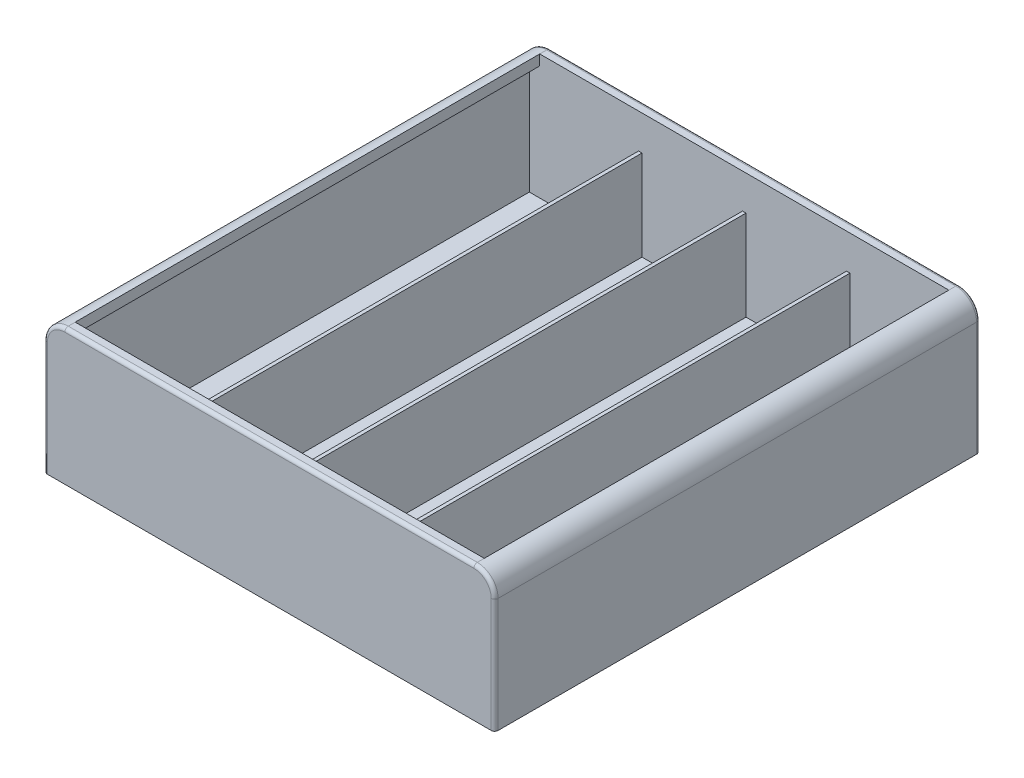
ISO-10303-21;
HEADER;
FILE_DESCRIPTION(('STEP AP214'),'2;1');
FILE_NAME('part.step','',(''),(''),'','','');
FILE_SCHEMA(('AUTOMOTIVE_DESIGN { 1 0 10303 214 1 1 1 1 }'));
ENDSEC;
DATA;
#1=APPLICATION_CONTEXT('core data for automotive mechanical design processes');
#2=APPLICATION_PROTOCOL_DEFINITION('international standard','automotive_design',2000,#1);
#3=PRODUCT_CONTEXT('',#1,'mechanical');
#4=PRODUCT('Part','Part','',(#3));
#5=PRODUCT_RELATED_PRODUCT_CATEGORY('part','',(#4));
#6=PRODUCT_DEFINITION_FORMATION('','',#4);
#7=PRODUCT_DEFINITION_CONTEXT('part definition',#1,'design');
#8=PRODUCT_DEFINITION('design','',#6,#7);
#9=PRODUCT_DEFINITION_SHAPE('','',#8);
#10=(LENGTH_UNIT() NAMED_UNIT(*) SI_UNIT(.MILLI.,.METRE.));
#11=(NAMED_UNIT(*) PLANE_ANGLE_UNIT() SI_UNIT($,.RADIAN.));
#12=(NAMED_UNIT(*) SI_UNIT($,.STERADIAN.) SOLID_ANGLE_UNIT());
#13=UNCERTAINTY_MEASURE_WITH_UNIT(LENGTH_MEASURE(1.E-05),#10,'distance_accuracy_value','');
#14=(GEOMETRIC_REPRESENTATION_CONTEXT(3) GLOBAL_UNCERTAINTY_ASSIGNED_CONTEXT((#13)) GLOBAL_UNIT_ASSIGNED_CONTEXT((#10,
#11,#12)) REPRESENTATION_CONTEXT('',''));
#15=CARTESIAN_POINT('',(0.,0.,0.));
#16=DIRECTION('',(0.,0.,1.));
#17=DIRECTION('',(1.,0.,0.));
#18=AXIS2_PLACEMENT_3D('',#15,#16,#17);
#19=CARTESIAN_POINT('',(32.5,19.5,33.5));
#20=DIRECTION('',(0.,0.,-1.));
#21=DIRECTION('',(-1.,0.,0.));
#22=AXIS2_PLACEMENT_3D('',#19,#20,#21);
#23=PLANE('',#22);
#24=DIRECTION('',(1.,0.,0.));
#25=VECTOR('',#24,1.);
#26=CARTESIAN_POINT('',(0.,1.5,33.5));
#27=LINE('',#26,#25);
#28=CARTESIAN_POINT('',(-14.75,1.5,33.5));
#29=VERTEX_POINT('',#28);
#30=CARTESIAN_POINT('',(-0.249999999999988,1.5,33.5));
#31=VERTEX_POINT('',#30);
#32=EDGE_CURVE('E322',#29,#31,#27,.T.);
#33=ORIENTED_EDGE('',*,*,#32,.F.);
#34=DIRECTION('',(0.,-1.,0.));
#35=VECTOR('',#34,1.);
#36=CARTESIAN_POINT('',(-14.75,86.5018656456669,33.5));
#37=LINE('',#36,#35);
#38=CARTESIAN_POINT('',(-14.75,14.5,33.5));
#39=VERTEX_POINT('',#38);
#40=EDGE_CURVE('E259',#39,#29,#37,.T.);
#41=ORIENTED_EDGE('',*,*,#40,.F.);
#42=DIRECTION('',(1.,0.,0.));
#43=VECTOR('',#42,1.);
#44=CARTESIAN_POINT('',(-14.75,14.5,33.5));
#45=LINE('',#44,#43);
#46=CARTESIAN_POINT('',(-15.25,14.5,33.5));
#47=VERTEX_POINT('',#46);
#48=EDGE_CURVE('E562',#47,#39,#45,.T.);
#49=ORIENTED_EDGE('',*,*,#48,.F.);
#50=DIRECTION('',(0.,-1.,0.));
#51=VECTOR('',#50,1.);
#52=CARTESIAN_POINT('',(-15.25,86.5018656456669,33.5));
#53=LINE('',#52,#51);
#54=CARTESIAN_POINT('',(-15.25,1.5,33.5));
#55=VERTEX_POINT('',#54);
#56=EDGE_CURVE('E556',#47,#55,#53,.T.);
#57=ORIENTED_EDGE('',*,*,#56,.T.);
#58=CARTESIAN_POINT('',(-31.,1.5,33.5));
#59=VERTEX_POINT('',#58);
#60=EDGE_CURVE('E319',#59,#55,#27,.T.);
#61=ORIENTED_EDGE('',*,*,#60,.F.);
#62=DIRECTION('',(0.,1.,0.));
#63=VECTOR('',#62,1.);
#64=CARTESIAN_POINT('',(-31.,19.5,33.5));
#65=LINE('',#64,#63);
#66=CARTESIAN_POINT('',(-31.,16.5,33.5));
#67=VERTEX_POINT('',#66);
#68=EDGE_CURVE('E306',#59,#67,#65,.T.);
#69=ORIENTED_EDGE('',*,*,#68,.T.);
#70=CARTESIAN_POINT('',(-29.5,16.5,33.5));
#71=DIRECTION('',(0.,0.,-1.));
#72=DIRECTION('',(-1.,0.,0.));
#73=AXIS2_PLACEMENT_3D('',#70,#71,#72);
#74=CIRCLE('',#73,1.5);
#75=CARTESIAN_POINT('',(-29.5,18.,33.5));
#76=VERTEX_POINT('',#75);
#77=EDGE_CURVE('E315',#67,#76,#74,.T.);
#78=ORIENTED_EDGE('',*,*,#77,.T.);
#79=DIRECTION('',(0.,1.,0.));
#80=VECTOR('',#79,1.);
#81=CARTESIAN_POINT('',(-29.5,19.5,33.5));
#82=LINE('',#81,#80);
#83=CARTESIAN_POINT('',(-29.5,19.5,33.5));
#84=VERTEX_POINT('',#83);
#85=EDGE_CURVE('E358',#84,#76,#82,.F.);
#86=ORIENTED_EDGE('',*,*,#85,.F.);
#87=DIRECTION('',(1.,0.,0.));
#88=VECTOR('',#87,1.);
#89=CARTESIAN_POINT('',(0.,19.5,33.5));
#90=LINE('',#89,#88);
#91=CARTESIAN_POINT('',(29.5,19.5,33.5));
#92=VERTEX_POINT('',#91);
#93=EDGE_CURVE('E348',#84,#92,#90,.T.);
#94=ORIENTED_EDGE('',*,*,#93,.T.);
#95=DIRECTION('',(0.,1.,0.));
#96=VECTOR('',#95,1.);
#97=CARTESIAN_POINT('',(29.5,19.5,33.5));
#98=LINE('',#97,#96);
#99=CARTESIAN_POINT('',(29.5,18.,33.5));
#100=VERTEX_POINT('',#99);
#101=EDGE_CURVE('E350',#92,#100,#98,.F.);
#102=ORIENTED_EDGE('',*,*,#101,.T.);
#103=CARTESIAN_POINT('',(29.5,16.5,33.5));
#104=DIRECTION('',(0.,0.,-1.));
#105=DIRECTION('',(-1.,0.,0.));
#106=AXIS2_PLACEMENT_3D('',#103,#104,#105);
#107=CIRCLE('',#106,1.5);
#108=CARTESIAN_POINT('',(31.,16.5,33.5));
#109=VERTEX_POINT('',#108);
#110=EDGE_CURVE('E328',#100,#109,#107,.T.);
#111=ORIENTED_EDGE('',*,*,#110,.T.);
#112=DIRECTION('',(0.,-1.,0.));
#113=VECTOR('',#112,1.);
#114=CARTESIAN_POINT('',(31.,19.5,33.5));
#115=LINE('',#114,#113);
#116=CARTESIAN_POINT('',(31.,1.5,33.5));
#117=VERTEX_POINT('',#116);
#118=EDGE_CURVE('E324',#109,#117,#115,.T.);
#119=ORIENTED_EDGE('',*,*,#118,.T.);
#120=CARTESIAN_POINT('',(15.25,1.5,33.5));
#121=VERTEX_POINT('',#120);
#122=EDGE_CURVE('E305',#121,#117,#27,.T.);
#123=ORIENTED_EDGE('',*,*,#122,.F.);
#124=DIRECTION('',(0.,-1.,0.));
#125=VECTOR('',#124,1.);
#126=CARTESIAN_POINT('',(15.25,86.5018656456669,33.5));
#127=LINE('',#126,#125);
#128=CARTESIAN_POINT('',(15.25,14.5,33.5));
#129=VERTEX_POINT('',#128);
#130=EDGE_CURVE('E578',#129,#121,#127,.T.);
#131=ORIENTED_EDGE('',*,*,#130,.F.);
#132=DIRECTION('',(1.,0.,0.));
#133=VECTOR('',#132,1.);
#134=CARTESIAN_POINT('',(15.25,14.5,33.5));
#135=LINE('',#134,#133);
#136=CARTESIAN_POINT('',(14.75,14.5,33.5));
#137=VERTEX_POINT('',#136);
#138=EDGE_CURVE('E574',#137,#129,#135,.T.);
#139=ORIENTED_EDGE('',*,*,#138,.F.);
#140=DIRECTION('',(0.,-1.,0.));
#141=VECTOR('',#140,1.);
#142=CARTESIAN_POINT('',(14.75,86.5018656456669,33.5));
#143=LINE('',#142,#141);
#144=CARTESIAN_POINT('',(14.75,1.5,33.5));
#145=VERTEX_POINT('',#144);
#146=EDGE_CURVE('E580',#137,#145,#143,.T.);
#147=ORIENTED_EDGE('',*,*,#146,.T.);
#148=CARTESIAN_POINT('',(0.250000000000012,1.5,33.5));
#149=VERTEX_POINT('',#148);
#150=EDGE_CURVE('E323',#149,#145,#27,.T.);
#151=ORIENTED_EDGE('',*,*,#150,.F.);
#152=DIRECTION('',(0.,-1.,0.));
#153=VECTOR('',#152,1.);
#154=CARTESIAN_POINT('',(0.250000000000012,86.5018656456669,33.5));
#155=LINE('',#154,#153);
#156=CARTESIAN_POINT('',(0.250000000000012,14.5,33.5));
#157=VERTEX_POINT('',#156);
#158=EDGE_CURVE('E599',#157,#149,#155,.T.);
#159=ORIENTED_EDGE('',*,*,#158,.F.);
#160=DIRECTION('',(1.,0.,0.));
#161=VECTOR('',#160,1.);
#162=CARTESIAN_POINT('',(0.250000000000012,14.5,33.5));
#163=LINE('',#162,#161);
#164=CARTESIAN_POINT('',(-0.249999999999988,14.5,33.5));
#165=VERTEX_POINT('',#164);
#166=EDGE_CURVE('E300',#165,#157,#163,.T.);
#167=ORIENTED_EDGE('',*,*,#166,.F.);
#168=DIRECTION('',(0.,-1.,0.));
#169=VECTOR('',#168,1.);
#170=CARTESIAN_POINT('',(-0.249999999999988,86.5018656456669,33.5));
#171=LINE('',#170,#169);
#172=EDGE_CURVE('E601',#165,#31,#171,.T.);
#173=ORIENTED_EDGE('',*,*,#172,.T.);
#174=EDGE_LOOP('',(#33,#41,#49,#57,#61,#69,#78,#86,#94,#102,#111,#119,#123,#131,#139,#147,#151,
#159,#167,#173));
#175=FACE_BOUND('',#174,.T.);
#176=ADVANCED_FACE('F40',(#175),#23,.T.);
#177=CARTESIAN_POINT('',(32.5,19.5,-33.5));
#178=DIRECTION('',(0.,0.,1.));
#179=DIRECTION('',(1.,0.,0.));
#180=AXIS2_PLACEMENT_3D('',#177,#178,#179);
#181=PLANE('',#180);
#182=DIRECTION('',(-1.,0.,0.));
#183=VECTOR('',#182,1.);
#184=CARTESIAN_POINT('',(-15.25,14.5,-33.5));
#185=LINE('',#184,#183);
#186=CARTESIAN_POINT('',(-14.75,14.5,-33.5));
#187=VERTEX_POINT('',#186);
#188=CARTESIAN_POINT('',(-15.25,14.5,-33.5));
#189=VERTEX_POINT('',#188);
#190=EDGE_CURVE('E270',#187,#189,#185,.T.);
#191=ORIENTED_EDGE('',*,*,#190,.F.);
#192=DIRECTION('',(0.,-1.,0.));
#193=VECTOR('',#192,1.);
#194=CARTESIAN_POINT('',(-14.75,86.5018656456669,-33.5));
#195=LINE('',#194,#193);
#196=CARTESIAN_POINT('',(-14.75,1.5,-33.5));
#197=VERTEX_POINT('',#196);
#198=EDGE_CURVE('E256',#187,#197,#195,.T.);
#199=ORIENTED_EDGE('',*,*,#198,.T.);
#200=DIRECTION('',(-1.,0.,0.));
#201=VECTOR('',#200,1.);
#202=CARTESIAN_POINT('',(0.,1.5,-33.5));
#203=LINE('',#202,#201);
#204=CARTESIAN_POINT('',(-0.249999999999994,1.5,-33.5));
#205=VERTEX_POINT('',#204);
#206=EDGE_CURVE('E269',#205,#197,#203,.T.);
#207=ORIENTED_EDGE('',*,*,#206,.F.);
#208=DIRECTION('',(0.,-1.,0.));
#209=VECTOR('',#208,1.);
#210=CARTESIAN_POINT('',(-0.25,86.5018656456669,-33.5));
#211=LINE('',#210,#209);
#212=CARTESIAN_POINT('',(-0.25,14.5,-33.5));
#213=VERTEX_POINT('',#212);
#214=EDGE_CURVE('E604',#213,#205,#211,.T.);
#215=ORIENTED_EDGE('',*,*,#214,.F.);
#216=DIRECTION('',(-1.,0.,0.));
#217=VECTOR('',#216,1.);
#218=CARTESIAN_POINT('',(-0.25,14.5,-33.5));
#219=LINE('',#218,#217);
#220=CARTESIAN_POINT('',(0.25,14.5,-33.5));
#221=VERTEX_POINT('',#220);
#222=EDGE_CURVE('E590',#221,#213,#219,.T.);
#223=ORIENTED_EDGE('',*,*,#222,.F.);
#224=DIRECTION('',(0.,-1.,0.));
#225=VECTOR('',#224,1.);
#226=CARTESIAN_POINT('',(0.25,86.5018656456669,-33.5));
#227=LINE('',#226,#225);
#228=CARTESIAN_POINT('',(0.25,1.5,-33.5));
#229=VERTEX_POINT('',#228);
#230=EDGE_CURVE('E591',#221,#229,#227,.T.);
#231=ORIENTED_EDGE('',*,*,#230,.T.);
#232=CARTESIAN_POINT('',(14.75,1.5,-33.5));
#233=VERTEX_POINT('',#232);
#234=EDGE_CURVE('E277',#233,#229,#203,.T.);
#235=ORIENTED_EDGE('',*,*,#234,.F.);
#236=DIRECTION('',(0.,-1.,0.));
#237=VECTOR('',#236,1.);
#238=CARTESIAN_POINT('',(14.75,86.5018656456669,-33.5));
#239=LINE('',#238,#237);
#240=CARTESIAN_POINT('',(14.75,14.5,-33.5));
#241=VERTEX_POINT('',#240);
#242=EDGE_CURVE('E65',#241,#233,#239,.T.);
#243=ORIENTED_EDGE('',*,*,#242,.F.);
#244=DIRECTION('',(-1.,0.,0.));
#245=VECTOR('',#244,1.);
#246=CARTESIAN_POINT('',(14.75,14.5,-33.5));
#247=LINE('',#246,#245);
#248=CARTESIAN_POINT('',(15.25,14.5,-33.5));
#249=VERTEX_POINT('',#248);
#250=EDGE_CURVE('E568',#249,#241,#247,.T.);
#251=ORIENTED_EDGE('',*,*,#250,.F.);
#252=DIRECTION('',(0.,-1.,0.));
#253=VECTOR('',#252,1.);
#254=CARTESIAN_POINT('',(15.25,86.5018656456669,-33.5));
#255=LINE('',#254,#253);
#256=CARTESIAN_POINT('',(15.25,1.5,-33.5));
#257=VERTEX_POINT('',#256);
#258=EDGE_CURVE('E569',#249,#257,#255,.T.);
#259=ORIENTED_EDGE('',*,*,#258,.T.);
#260=CARTESIAN_POINT('',(31.,1.5,-33.5));
#261=VERTEX_POINT('',#260);
#262=EDGE_CURVE('E280',#261,#257,#203,.T.);
#263=ORIENTED_EDGE('',*,*,#262,.F.);
#264=DIRECTION('',(0.,1.,0.));
#265=VECTOR('',#264,1.);
#266=CARTESIAN_POINT('',(31.,19.5,-33.5));
#267=LINE('',#266,#265);
#268=CARTESIAN_POINT('',(31.,16.5,-33.5));
#269=VERTEX_POINT('',#268);
#270=EDGE_CURVE('E318',#261,#269,#267,.T.);
#271=ORIENTED_EDGE('',*,*,#270,.T.);
#272=CARTESIAN_POINT('',(29.5,16.5,-33.5));
#273=DIRECTION('',(0.,0.,1.));
#274=DIRECTION('',(1.,0.,0.));
#275=AXIS2_PLACEMENT_3D('',#272,#273,#274);
#276=CIRCLE('',#275,1.5);
#277=CARTESIAN_POINT('',(29.5,18.,-33.5));
#278=VERTEX_POINT('',#277);
#279=EDGE_CURVE('E327',#269,#278,#276,.T.);
#280=ORIENTED_EDGE('',*,*,#279,.T.);
#281=DIRECTION('',(0.,-1.,0.));
#282=VECTOR('',#281,1.);
#283=CARTESIAN_POINT('',(29.5,19.5,-33.5));
#284=LINE('',#283,#282);
#285=CARTESIAN_POINT('',(29.5,19.5,-33.5));
#286=VERTEX_POINT('',#285);
#287=EDGE_CURVE('E338',#278,#286,#284,.F.);
#288=ORIENTED_EDGE('',*,*,#287,.T.);
#289=DIRECTION('',(-1.,0.,0.));
#290=VECTOR('',#289,1.);
#291=CARTESIAN_POINT('',(0.,19.5,-33.5));
#292=LINE('',#291,#290);
#293=CARTESIAN_POINT('',(-29.5,19.5,-33.5));
#294=VERTEX_POINT('',#293);
#295=EDGE_CURVE('E347',#286,#294,#292,.T.);
#296=ORIENTED_EDGE('',*,*,#295,.T.);
#297=DIRECTION('',(0.,1.,0.));
#298=VECTOR('',#297,1.);
#299=CARTESIAN_POINT('',(-29.5,19.5,-33.5));
#300=LINE('',#299,#298);
#301=CARTESIAN_POINT('',(-29.5,18.,-33.5));
#302=VERTEX_POINT('',#301);
#303=EDGE_CURVE('E360',#294,#302,#300,.F.);
#304=ORIENTED_EDGE('',*,*,#303,.T.);
#305=CARTESIAN_POINT('',(-29.5,16.5,-33.5));
#306=DIRECTION('',(0.,0.,1.));
#307=DIRECTION('',(1.,0.,0.));
#308=AXIS2_PLACEMENT_3D('',#305,#306,#307);
#309=CIRCLE('',#308,1.5);
#310=CARTESIAN_POINT('',(-31.,16.5,-33.5));
#311=VERTEX_POINT('',#310);
#312=EDGE_CURVE('E309',#302,#311,#309,.T.);
#313=ORIENTED_EDGE('',*,*,#312,.T.);
#314=DIRECTION('',(0.,-1.,0.));
#315=VECTOR('',#314,1.);
#316=CARTESIAN_POINT('',(-31.,19.5,-33.5));
#317=LINE('',#316,#315);
#318=CARTESIAN_POINT('',(-31.,1.5,-33.5));
#319=VERTEX_POINT('',#318);
#320=EDGE_CURVE('E310',#311,#319,#317,.T.);
#321=ORIENTED_EDGE('',*,*,#320,.T.);
#322=CARTESIAN_POINT('',(-15.25,1.5,-33.5));
#323=VERTEX_POINT('',#322);
#324=EDGE_CURVE('E278',#323,#319,#203,.T.);
#325=ORIENTED_EDGE('',*,*,#324,.F.);
#326=DIRECTION('',(0.,-1.,0.));
#327=VECTOR('',#326,1.);
#328=CARTESIAN_POINT('',(-15.25,86.5018656456669,-33.5));
#329=LINE('',#328,#327);
#330=EDGE_CURVE('E57',#189,#323,#329,.T.);
#331=ORIENTED_EDGE('',*,*,#330,.F.);
#332=EDGE_LOOP('',(#191,#199,#207,#215,#223,#231,#235,#243,#251,#259,#263,#271,#280,#288,#296,
#304,#313,#321,#325,#331));
#333=FACE_BOUND('',#332,.T.);
#334=ADVANCED_FACE('F267',(#333),#181,.T.);
#335=CARTESIAN_POINT('',(0.,1.5,0.));
#336=DIRECTION('',(0.,-1.,0.));
#337=DIRECTION('',(0.,0.,-1.));
#338=AXIS2_PLACEMENT_3D('',#335,#336,#337);
#339=PLANE('',#338);
#340=DIRECTION('',(0.,0.,-1.));
#341=VECTOR('',#340,1.);
#342=CARTESIAN_POINT('',(-14.75,1.5,33.5));
#343=LINE('',#342,#341);
#344=EDGE_CURVE('E252',#29,#197,#343,.T.);
#345=ORIENTED_EDGE('',*,*,#344,.F.);
#346=ORIENTED_EDGE('',*,*,#32,.T.);
#347=DIRECTION('',(0.,0.,-1.));
#348=VECTOR('',#347,1.);
#349=CARTESIAN_POINT('',(-0.249999999999988,1.5,33.5));
#350=LINE('',#349,#348);
#351=EDGE_CURVE('E276',#31,#205,#350,.T.);
#352=ORIENTED_EDGE('',*,*,#351,.T.);
#353=ORIENTED_EDGE('',*,*,#206,.T.);
#354=EDGE_LOOP('',(#345,#346,#352,#353));
#355=FACE_BOUND('',#354,.T.);
#356=ADVANCED_FACE('F274',(#355),#339,.F.);
#357=DIRECTION('',(0.,0.,-1.));
#358=VECTOR('',#357,1.);
#359=CARTESIAN_POINT('',(15.25,1.5,33.5));
#360=LINE('',#359,#358);
#361=EDGE_CURVE('E564',#121,#257,#360,.T.);
#362=ORIENTED_EDGE('',*,*,#361,.F.);
#363=ORIENTED_EDGE('',*,*,#122,.T.);
#364=DIRECTION('',(0.,0.,-1.));
#365=VECTOR('',#364,1.);
#366=CARTESIAN_POINT('',(31.,1.5,0.));
#367=LINE('',#366,#365);
#368=EDGE_CURVE('E281',#117,#261,#367,.T.);
#369=ORIENTED_EDGE('',*,*,#368,.T.);
#370=ORIENTED_EDGE('',*,*,#262,.T.);
#371=EDGE_LOOP('',(#362,#363,#369,#370));
#372=FACE_BOUND('',#371,.T.);
#373=ADVANCED_FACE('F621',(#372),#339,.F.);
#374=ORIENTED_EDGE('',*,*,#150,.T.);
#375=DIRECTION('',(0.,0.,-1.));
#376=VECTOR('',#375,1.);
#377=CARTESIAN_POINT('',(14.75,1.5,33.5));
#378=LINE('',#377,#376);
#379=EDGE_CURVE('E576',#145,#233,#378,.T.);
#380=ORIENTED_EDGE('',*,*,#379,.T.);
#381=ORIENTED_EDGE('',*,*,#234,.T.);
#382=DIRECTION('',(0.,0.,-1.));
#383=VECTOR('',#382,1.);
#384=CARTESIAN_POINT('',(0.250000000000012,1.5,33.5));
#385=LINE('',#384,#383);
#386=EDGE_CURVE('E587',#149,#229,#385,.T.);
#387=ORIENTED_EDGE('',*,*,#386,.F.);
#388=EDGE_LOOP('',(#374,#380,#381,#387));
#389=FACE_BOUND('',#388,.T.);
#390=ADVANCED_FACE('F616',(#389),#339,.F.);
#391=CARTESIAN_POINT('',(0.,19.5,0.));
#392=DIRECTION('',(0.,-1.,0.));
#393=DIRECTION('',(0.,0.,-1.));
#394=AXIS2_PLACEMENT_3D('',#391,#392,#393);
#395=PLANE('',#394);
#396=ORIENTED_EDGE('',*,*,#93,.F.);
#397=DIRECTION('',(0.,0.,1.));
#398=VECTOR('',#397,1.);
#399=CARTESIAN_POINT('',(-29.5,19.5,0.));
#400=LINE('',#399,#398);
#401=CARTESIAN_POINT('',(-29.5,19.5,34.5));
#402=VERTEX_POINT('',#401);
#403=EDGE_CURVE('E377',#84,#402,#400,.T.);
#404=ORIENTED_EDGE('',*,*,#403,.T.);
#405=DIRECTION('',(1.,0.,0.));
#406=VECTOR('',#405,1.);
#407=CARTESIAN_POINT('',(0.,19.5,34.5));
#408=LINE('',#407,#406);
#409=CARTESIAN_POINT('',(29.5,19.5,34.5));
#410=VERTEX_POINT('',#409);
#411=EDGE_CURVE('E12',#402,#410,#408,.T.);
#412=ORIENTED_EDGE('',*,*,#411,.T.);
#413=DIRECTION('',(0.,0.,-1.));
#414=VECTOR('',#413,1.);
#415=CARTESIAN_POINT('',(29.5,19.5,0.));
#416=LINE('',#415,#414);
#417=EDGE_CURVE('E382',#410,#92,#416,.T.);
#418=ORIENTED_EDGE('',*,*,#417,.T.);
#419=EDGE_LOOP('',(#396,#404,#412,#418));
#420=FACE_BOUND('',#419,.T.);
#421=ADVANCED_FACE('F502',(#420),#395,.F.);
#422=ORIENTED_EDGE('',*,*,#295,.F.);
#423=CARTESIAN_POINT('',(29.5,19.5,-34.5));
#424=VERTEX_POINT('',#423);
#425=EDGE_CURVE('E381',#286,#424,#416,.T.);
#426=ORIENTED_EDGE('',*,*,#425,.T.);
#427=DIRECTION('',(-1.,0.,0.));
#428=VECTOR('',#427,1.);
#429=CARTESIAN_POINT('',(0.,19.5,-34.5));
#430=LINE('',#429,#428);
#431=CARTESIAN_POINT('',(-29.5,19.5,-34.5));
#432=VERTEX_POINT('',#431);
#433=EDGE_CURVE('E49',#424,#432,#430,.T.);
#434=ORIENTED_EDGE('',*,*,#433,.T.);
#435=EDGE_CURVE('E378',#432,#294,#400,.T.);
#436=ORIENTED_EDGE('',*,*,#435,.T.);
#437=EDGE_LOOP('',(#422,#426,#434,#436));
#438=FACE_BOUND('',#437,.T.);
#439=ADVANCED_FACE('F536',(#438),#395,.F.);
#440=CARTESIAN_POINT('',(-32.5,19.5,-35.));
#441=DIRECTION('',(1.,0.,0.));
#442=DIRECTION('',(0.,0.,-1.));
#443=AXIS2_PLACEMENT_3D('',#440,#441,#442);
#444=PLANE('',#443);
#445=DIRECTION('',(0.,0.,1.));
#446=VECTOR('',#445,1.);
#447=CARTESIAN_POINT('',(-32.5,0.,-35.));
#448=LINE('',#447,#446);
#449=CARTESIAN_POINT('',(-32.5,0.,-34.5));
#450=VERTEX_POINT('',#449);
#451=CARTESIAN_POINT('',(-32.5,0.,34.5));
#452=VERTEX_POINT('',#451);
#453=EDGE_CURVE('E364',#450,#452,#448,.T.);
#454=ORIENTED_EDGE('',*,*,#453,.T.);
#455=DIRECTION('',(0.,-1.,0.));
#456=VECTOR('',#455,1.);
#457=CARTESIAN_POINT('',(-32.5,19.5,34.5));
#458=LINE('',#457,#456);
#459=CARTESIAN_POINT('',(-32.5,16.5,34.5));
#460=VERTEX_POINT('',#459);
#461=EDGE_CURVE('E412',#452,#460,#458,.F.);
#462=ORIENTED_EDGE('',*,*,#461,.T.);
#463=DIRECTION('',(0.,0.,1.));
#464=VECTOR('',#463,1.);
#465=CARTESIAN_POINT('',(-32.5,16.5,-35.));
#466=LINE('',#465,#464);
#467=CARTESIAN_POINT('',(-32.5,16.5,-34.5));
#468=VERTEX_POINT('',#467);
#469=EDGE_CURVE('E388',#460,#468,#466,.F.);
#470=ORIENTED_EDGE('',*,*,#469,.T.);
#471=DIRECTION('',(0.,-1.,0.));
#472=VECTOR('',#471,1.);
#473=CARTESIAN_POINT('',(-32.5,19.5,-34.5));
#474=LINE('',#473,#472);
#475=EDGE_CURVE('E410',#468,#450,#474,.T.);
#476=ORIENTED_EDGE('',*,*,#475,.T.);
#477=EDGE_LOOP('',(#454,#462,#470,#476));
#478=FACE_BOUND('',#477,.T.);
#479=ADVANCED_FACE('F473',(#478),#444,.F.);
#480=CARTESIAN_POINT('',(32.5,19.5,35.));
#481=DIRECTION('',(0.,0.,-1.));
#482=DIRECTION('',(-1.,0.,0.));
#483=AXIS2_PLACEMENT_3D('',#480,#481,#482);
#484=PLANE('',#483);
#485=CARTESIAN_POINT('',(-29.5,16.5,35.));
#486=DIRECTION('',(0.,0.,-1.));
#487=DIRECTION('',(-1.,0.,0.));
#488=AXIS2_PLACEMENT_3D('',#485,#486,#487);
#489=CIRCLE('',#488,2.5);
#490=CARTESIAN_POINT('',(-29.5,19.,35.));
#491=VERTEX_POINT('',#490);
#492=CARTESIAN_POINT('',(-32.,16.5,35.));
#493=VERTEX_POINT('',#492);
#494=EDGE_CURVE('E397',#491,#493,#489,.F.);
#495=ORIENTED_EDGE('',*,*,#494,.T.);
#496=DIRECTION('',(0.,-1.,0.));
#497=VECTOR('',#496,1.);
#498=CARTESIAN_POINT('',(-32.,19.5,35.));
#499=LINE('',#498,#497);
#500=CARTESIAN_POINT('',(-32.,0.,35.));
#501=VERTEX_POINT('',#500);
#502=EDGE_CURVE('E399',#493,#501,#499,.T.);
#503=ORIENTED_EDGE('',*,*,#502,.T.);
#504=DIRECTION('',(1.,0.,0.));
#505=VECTOR('',#504,1.);
#506=CARTESIAN_POINT('',(32.5,0.,35.));
#507=LINE('',#506,#505);
#508=CARTESIAN_POINT('',(32.,0.,35.));
#509=VERTEX_POINT('',#508);
#510=EDGE_CURVE('E367',#501,#509,#507,.T.);
#511=ORIENTED_EDGE('',*,*,#510,.T.);
#512=DIRECTION('',(0.,-1.,0.));
#513=VECTOR('',#512,1.);
#514=CARTESIAN_POINT('',(32.,19.5,35.));
#515=LINE('',#514,#513);
#516=CARTESIAN_POINT('',(32.,16.5,35.));
#517=VERTEX_POINT('',#516);
#518=EDGE_CURVE('E395',#509,#517,#515,.F.);
#519=ORIENTED_EDGE('',*,*,#518,.T.);
#520=CARTESIAN_POINT('',(29.5,16.5,35.));
#521=DIRECTION('',(0.,0.,-1.));
#522=DIRECTION('',(-1.,0.,0.));
#523=AXIS2_PLACEMENT_3D('',#520,#521,#522);
#524=CIRCLE('',#523,2.5);
#525=CARTESIAN_POINT('',(29.5,19.,35.));
#526=VERTEX_POINT('',#525);
#527=EDGE_CURVE('E393',#517,#526,#524,.F.);
#528=ORIENTED_EDGE('',*,*,#527,.T.);
#529=DIRECTION('',(1.,0.,0.));
#530=VECTOR('',#529,1.);
#531=CARTESIAN_POINT('',(32.5,19.,35.));
#532=LINE('',#531,#530);
#533=EDGE_CURVE('E391',#526,#491,#532,.F.);
#534=ORIENTED_EDGE('',*,*,#533,.T.);
#535=EDGE_LOOP('',(#495,#503,#511,#519,#528,#534));
#536=FACE_BOUND('',#535,.T.);
#537=ADVANCED_FACE('F484',(#536),#484,.F.);
#538=CARTESIAN_POINT('',(32.5,19.5,-35.));
#539=DIRECTION('',(-1.,0.,0.));
#540=DIRECTION('',(0.,0.,1.));
#541=AXIS2_PLACEMENT_3D('',#538,#539,#540);
#542=PLANE('',#541);
#543=DIRECTION('',(0.,0.,-1.));
#544=VECTOR('',#543,1.);
#545=CARTESIAN_POINT('',(32.5,16.5,-35.));
#546=LINE('',#545,#544);
#547=CARTESIAN_POINT('',(32.5,16.5,-34.5));
#548=VERTEX_POINT('',#547);
#549=CARTESIAN_POINT('',(32.5,16.5,34.5));
#550=VERTEX_POINT('',#549);
#551=EDGE_CURVE('E385',#548,#550,#546,.F.);
#552=ORIENTED_EDGE('',*,*,#551,.T.);
#553=DIRECTION('',(0.,-1.,0.));
#554=VECTOR('',#553,1.);
#555=CARTESIAN_POINT('',(32.5,19.5,34.5));
#556=LINE('',#555,#554);
#557=CARTESIAN_POINT('',(32.5,0.,34.5));
#558=VERTEX_POINT('',#557);
#559=EDGE_CURVE('E421',#550,#558,#556,.T.);
#560=ORIENTED_EDGE('',*,*,#559,.T.);
#561=DIRECTION('',(0.,0.,-1.));
#562=VECTOR('',#561,1.);
#563=CARTESIAN_POINT('',(32.5,0.,-35.));
#564=LINE('',#563,#562);
#565=CARTESIAN_POINT('',(32.5,0.,-34.5));
#566=VERTEX_POINT('',#565);
#567=EDGE_CURVE('E371',#558,#566,#564,.T.);
#568=ORIENTED_EDGE('',*,*,#567,.T.);
#569=DIRECTION('',(0.,-1.,0.));
#570=VECTOR('',#569,1.);
#571=CARTESIAN_POINT('',(32.5,19.5,-34.5));
#572=LINE('',#571,#570);
#573=EDGE_CURVE('E419',#566,#548,#572,.F.);
#574=ORIENTED_EDGE('',*,*,#573,.T.);
#575=EDGE_LOOP('',(#552,#560,#568,#574));
#576=FACE_BOUND('',#575,.T.);
#577=ADVANCED_FACE('F519',(#576),#542,.F.);
#578=CARTESIAN_POINT('',(32.5,19.5,-35.));
#579=DIRECTION('',(0.,0.,1.));
#580=DIRECTION('',(1.,0.,0.));
#581=AXIS2_PLACEMENT_3D('',#578,#579,#580);
#582=PLANE('',#581);
#583=CARTESIAN_POINT('',(29.5,16.5,-35.));
#584=DIRECTION('',(0.,0.,1.));
#585=DIRECTION('',(1.,0.,0.));
#586=AXIS2_PLACEMENT_3D('',#583,#584,#585);
#587=CIRCLE('',#586,2.5);
#588=CARTESIAN_POINT('',(29.5,19.,-35.));
#589=VERTEX_POINT('',#588);
#590=CARTESIAN_POINT('',(32.,16.5,-35.));
#591=VERTEX_POINT('',#590);
#592=EDGE_CURVE('E434',#589,#591,#587,.F.);
#593=ORIENTED_EDGE('',*,*,#592,.T.);
#594=DIRECTION('',(0.,-1.,0.));
#595=VECTOR('',#594,1.);
#596=CARTESIAN_POINT('',(32.,19.5,-35.));
#597=LINE('',#596,#595);
#598=CARTESIAN_POINT('',(32.,0.,-35.));
#599=VERTEX_POINT('',#598);
#600=EDGE_CURVE('E436',#591,#599,#597,.T.);
#601=ORIENTED_EDGE('',*,*,#600,.T.);
#602=DIRECTION('',(-1.,0.,0.));
#603=VECTOR('',#602,1.);
#604=CARTESIAN_POINT('',(32.5,0.,-35.));
#605=LINE('',#604,#603);
#606=CARTESIAN_POINT('',(-32.,0.,-35.));
#607=VERTEX_POINT('',#606);
#608=EDGE_CURVE('E374',#599,#607,#605,.T.);
#609=ORIENTED_EDGE('',*,*,#608,.T.);
#610=DIRECTION('',(0.,-1.,0.));
#611=VECTOR('',#610,1.);
#612=CARTESIAN_POINT('',(-32.,19.5,-35.));
#613=LINE('',#612,#611);
#614=CARTESIAN_POINT('',(-32.,16.5,-35.));
#615=VERTEX_POINT('',#614);
#616=EDGE_CURVE('E432',#607,#615,#613,.F.);
#617=ORIENTED_EDGE('',*,*,#616,.T.);
#618=CARTESIAN_POINT('',(-29.5,16.5,-35.));
#619=DIRECTION('',(0.,0.,1.));
#620=DIRECTION('',(1.,0.,0.));
#621=AXIS2_PLACEMENT_3D('',#618,#619,#620);
#622=CIRCLE('',#621,2.5);
#623=CARTESIAN_POINT('',(-29.5,19.,-35.));
#624=VERTEX_POINT('',#623);
#625=EDGE_CURVE('E430',#615,#624,#622,.F.);
#626=ORIENTED_EDGE('',*,*,#625,.T.);
#627=DIRECTION('',(-1.,0.,0.));
#628=VECTOR('',#627,1.);
#629=CARTESIAN_POINT('',(32.5,19.,-35.));
#630=LINE('',#629,#628);
#631=EDGE_CURVE('E428',#624,#589,#630,.F.);
#632=ORIENTED_EDGE('',*,*,#631,.T.);
#633=EDGE_LOOP('',(#593,#601,#609,#617,#626,#632));
#634=FACE_BOUND('',#633,.T.);
#635=ADVANCED_FACE('F525',(#634),#582,.F.);
#636=CARTESIAN_POINT('',(0.,0.,0.));
#637=DIRECTION('',(0.,-1.,0.));
#638=DIRECTION('',(0.,0.,-1.));
#639=AXIS2_PLACEMENT_3D('',#636,#637,#638);
#640=PLANE('',#639);
#641=ORIENTED_EDGE('',*,*,#510,.F.);
#642=CARTESIAN_POINT('',(-32.,0.,34.5));
#643=DIRECTION('',(0.,-1.,0.));
#644=DIRECTION('',(0.,0.,-1.));
#645=AXIS2_PLACEMENT_3D('',#642,#643,#644);
#646=CIRCLE('',#645,0.5);
#647=EDGE_CURVE('E408',#501,#452,#646,.T.);
#648=ORIENTED_EDGE('',*,*,#647,.T.);
#649=ORIENTED_EDGE('',*,*,#453,.F.);
#650=CARTESIAN_POINT('',(-32.,0.,-34.5));
#651=DIRECTION('',(0.,-1.,0.));
#652=DIRECTION('',(0.,0.,-1.));
#653=AXIS2_PLACEMENT_3D('',#650,#651,#652);
#654=CIRCLE('',#653,0.5);
#655=EDGE_CURVE('E402',#450,#607,#654,.T.);
#656=ORIENTED_EDGE('',*,*,#655,.T.);
#657=ORIENTED_EDGE('',*,*,#608,.F.);
#658=CARTESIAN_POINT('',(32.,0.,-34.5));
#659=DIRECTION('',(0.,-1.,0.));
#660=DIRECTION('',(0.,0.,-1.));
#661=AXIS2_PLACEMENT_3D('',#658,#659,#660);
#662=CIRCLE('',#661,0.5);
#663=EDGE_CURVE('E404',#599,#566,#662,.T.);
#664=ORIENTED_EDGE('',*,*,#663,.T.);
#665=ORIENTED_EDGE('',*,*,#567,.F.);
#666=CARTESIAN_POINT('',(32.,0.,34.5));
#667=DIRECTION('',(0.,-1.,0.));
#668=DIRECTION('',(0.,0.,-1.));
#669=AXIS2_PLACEMENT_3D('',#666,#667,#668);
#670=CIRCLE('',#669,0.5);
#671=EDGE_CURVE('E406',#558,#509,#670,.T.);
#672=ORIENTED_EDGE('',*,*,#671,.T.);
#673=EDGE_LOOP('',(#641,#648,#649,#656,#657,#664,#665,#672));
#674=FACE_BOUND('',#673,.T.);
#675=ADVANCED_FACE('F478',(#674),#640,.T.);
#676=CARTESIAN_POINT('',(29.5,16.5,0.));
#677=DIRECTION('',(0.,0.,-1.));
#678=DIRECTION('',(-1.,0.,0.));
#679=AXIS2_PLACEMENT_3D('',#676,#677,#678);
#680=CYLINDRICAL_SURFACE('',#679,3.);
#681=ORIENTED_EDGE('',*,*,#417,.F.);
#682=CARTESIAN_POINT('',(29.5,16.5,34.5));
#683=DIRECTION('',(0.,0.,-1.));
#684=DIRECTION('',(-1.,0.,0.));
#685=AXIS2_PLACEMENT_3D('',#682,#683,#684);
#686=CIRCLE('',#685,3.);
#687=EDGE_CURVE('E426',#410,#550,#686,.T.);
#688=ORIENTED_EDGE('',*,*,#687,.T.);
#689=ORIENTED_EDGE('',*,*,#551,.F.);
#690=CARTESIAN_POINT('',(29.5,16.5,-34.5));
#691=DIRECTION('',(0.,0.,1.));
#692=DIRECTION('',(1.,0.,0.));
#693=AXIS2_PLACEMENT_3D('',#690,#691,#692);
#694=CIRCLE('',#693,3.);
#695=EDGE_CURVE('E423',#548,#424,#694,.T.);
#696=ORIENTED_EDGE('',*,*,#695,.T.);
#697=ORIENTED_EDGE('',*,*,#425,.F.);
#698=DIRECTION('',(0.,0.,-1.));
#699=VECTOR('',#698,1.);
#700=CARTESIAN_POINT('',(29.5,19.5,0.));
#701=LINE('',#700,#699);
#702=EDGE_CURVE('E290',#92,#286,#701,.T.);
#703=ORIENTED_EDGE('',*,*,#702,.F.);
#704=EDGE_LOOP('',(#681,#688,#689,#696,#697,#703));
#705=FACE_BOUND('',#704,.T.);
#706=ADVANCED_FACE('F506',(#705),#680,.T.);
#707=CARTESIAN_POINT('',(-29.5,16.5,0.));
#708=DIRECTION('',(0.,0.,1.));
#709=DIRECTION('',(1.,0.,0.));
#710=AXIS2_PLACEMENT_3D('',#707,#708,#709);
#711=CYLINDRICAL_SURFACE('',#710,3.);
#712=ORIENTED_EDGE('',*,*,#469,.F.);
#713=CARTESIAN_POINT('',(-29.5,16.5,34.5));
#714=DIRECTION('',(0.,0.,-1.));
#715=DIRECTION('',(-1.,0.,0.));
#716=AXIS2_PLACEMENT_3D('',#713,#714,#715);
#717=CIRCLE('',#716,3.);
#718=EDGE_CURVE('E416',#460,#402,#717,.T.);
#719=ORIENTED_EDGE('',*,*,#718,.T.);
#720=ORIENTED_EDGE('',*,*,#403,.F.);
#721=DIRECTION('',(0.,0.,1.));
#722=VECTOR('',#721,1.);
#723=CARTESIAN_POINT('',(-29.5,19.5,0.));
#724=LINE('',#723,#722);
#725=EDGE_CURVE('E285',#294,#84,#724,.T.);
#726=ORIENTED_EDGE('',*,*,#725,.F.);
#727=ORIENTED_EDGE('',*,*,#435,.F.);
#728=CARTESIAN_POINT('',(-29.5,16.5,-34.5));
#729=DIRECTION('',(0.,0.,1.));
#730=DIRECTION('',(1.,0.,0.));
#731=AXIS2_PLACEMENT_3D('',#728,#729,#730);
#732=CIRCLE('',#731,3.);
#733=EDGE_CURVE('E414',#432,#468,#732,.T.);
#734=ORIENTED_EDGE('',*,*,#733,.T.);
#735=EDGE_LOOP('',(#712,#719,#720,#726,#727,#734));
#736=FACE_BOUND('',#735,.T.);
#737=ADVANCED_FACE('F496',(#736),#711,.T.);
#738=CARTESIAN_POINT('',(32.,19.5,34.5));
#739=DIRECTION('',(0.,-1.,0.));
#740=DIRECTION('',(0.,0.,-1.));
#741=AXIS2_PLACEMENT_3D('',#738,#739,#740);
#742=CYLINDRICAL_SURFACE('',#741,0.5);
#743=ORIENTED_EDGE('',*,*,#671,.F.);
#744=ORIENTED_EDGE('',*,*,#559,.F.);
#745=CARTESIAN_POINT('',(32.,16.5,34.5));
#746=DIRECTION('',(0.,1.,0.));
#747=DIRECTION('',(0.,0.,1.));
#748=AXIS2_PLACEMENT_3D('',#745,#746,#747);
#749=CIRCLE('',#748,0.5);
#750=EDGE_CURVE('E368',#517,#550,#749,.T.);
#751=ORIENTED_EDGE('',*,*,#750,.F.);
#752=ORIENTED_EDGE('',*,*,#518,.F.);
#753=EDGE_LOOP('',(#743,#744,#751,#752));
#754=FACE_BOUND('',#753,.T.);
#755=ADVANCED_FACE('F516',(#754),#742,.T.);
#756=CARTESIAN_POINT('',(29.5,16.5,34.5));
#757=DIRECTION('',(0.,0.,-1.));
#758=DIRECTION('',(-1.,0.,0.));
#759=AXIS2_PLACEMENT_3D('',#756,#757,#758);
#760=TOROIDAL_SURFACE('',#759,2.5,0.5);
#761=ORIENTED_EDGE('',*,*,#750,.T.);
#762=ORIENTED_EDGE('',*,*,#687,.F.);
#763=CARTESIAN_POINT('',(29.5,19.,34.5));
#764=DIRECTION('',(-1.,0.,0.));
#765=DIRECTION('',(0.,0.,1.));
#766=AXIS2_PLACEMENT_3D('',#763,#764,#765);
#767=CIRCLE('',#766,0.5);
#768=EDGE_CURVE('E446',#526,#410,#767,.T.);
#769=ORIENTED_EDGE('',*,*,#768,.F.);
#770=ORIENTED_EDGE('',*,*,#527,.F.);
#771=EDGE_LOOP('',(#761,#762,#769,#770));
#772=FACE_BOUND('',#771,.T.);
#773=ADVANCED_FACE('F510',(#772),#760,.T.);
#774=CARTESIAN_POINT('',(0.,19.,34.5));
#775=DIRECTION('',(1.,0.,0.));
#776=DIRECTION('',(0.,0.,-1.));
#777=AXIS2_PLACEMENT_3D('',#774,#775,#776);
#778=CYLINDRICAL_SURFACE('',#777,0.5);
#779=ORIENTED_EDGE('',*,*,#768,.T.);
#780=ORIENTED_EDGE('',*,*,#411,.F.);
#781=CARTESIAN_POINT('',(-29.5,19.,34.5));
#782=DIRECTION('',(-1.,0.,0.));
#783=DIRECTION('',(0.,0.,1.));
#784=AXIS2_PLACEMENT_3D('',#781,#782,#783);
#785=CIRCLE('',#784,0.5);
#786=EDGE_CURVE('E443',#491,#402,#785,.T.);
#787=ORIENTED_EDGE('',*,*,#786,.F.);
#788=ORIENTED_EDGE('',*,*,#533,.F.);
#789=EDGE_LOOP('',(#779,#780,#787,#788));
#790=FACE_BOUND('',#789,.T.);
#791=ADVANCED_FACE('F498',(#790),#778,.T.);
#792=CARTESIAN_POINT('',(-29.5,16.5,34.5));
#793=DIRECTION('',(0.,0.,-1.));
#794=DIRECTION('',(-1.,0.,0.));
#795=AXIS2_PLACEMENT_3D('',#792,#793,#794);
#796=TOROIDAL_SURFACE('',#795,2.5,0.5);
#797=ORIENTED_EDGE('',*,*,#786,.T.);
#798=ORIENTED_EDGE('',*,*,#718,.F.);
#799=CARTESIAN_POINT('',(-32.,16.5,34.5));
#800=DIRECTION('',(0.,-1.,0.));
#801=DIRECTION('',(0.,0.,-1.));
#802=AXIS2_PLACEMENT_3D('',#799,#800,#801);
#803=CIRCLE('',#802,0.5);
#804=EDGE_CURVE('E440',#493,#460,#803,.T.);
#805=ORIENTED_EDGE('',*,*,#804,.F.);
#806=ORIENTED_EDGE('',*,*,#494,.F.);
#807=EDGE_LOOP('',(#797,#798,#805,#806));
#808=FACE_BOUND('',#807,.T.);
#809=ADVANCED_FACE('F492',(#808),#796,.T.);
#810=CARTESIAN_POINT('',(-32.,19.5,34.5));
#811=DIRECTION('',(0.,-1.,0.));
#812=DIRECTION('',(0.,0.,-1.));
#813=AXIS2_PLACEMENT_3D('',#810,#811,#812);
#814=CYLINDRICAL_SURFACE('',#813,0.5);
#815=ORIENTED_EDGE('',*,*,#804,.T.);
#816=ORIENTED_EDGE('',*,*,#461,.F.);
#817=ORIENTED_EDGE('',*,*,#647,.F.);
#818=ORIENTED_EDGE('',*,*,#502,.F.);
#819=EDGE_LOOP('',(#815,#816,#817,#818));
#820=FACE_BOUND('',#819,.T.);
#821=ADVANCED_FACE('F482',(#820),#814,.T.);
#822=CARTESIAN_POINT('',(-32.,19.5,-34.5));
#823=DIRECTION('',(0.,-1.,0.));
#824=DIRECTION('',(0.,0.,-1.));
#825=AXIS2_PLACEMENT_3D('',#822,#823,#824);
#826=CYLINDRICAL_SURFACE('',#825,0.5);
#827=ORIENTED_EDGE('',*,*,#655,.F.);
#828=ORIENTED_EDGE('',*,*,#475,.F.);
#829=CARTESIAN_POINT('',(-32.,16.5,-34.5));
#830=DIRECTION('',(0.,1.,0.));
#831=DIRECTION('',(0.,0.,1.));
#832=AXIS2_PLACEMENT_3D('',#829,#830,#831);
#833=CIRCLE('',#832,0.5);
#834=EDGE_CURVE('E44',#615,#468,#833,.T.);
#835=ORIENTED_EDGE('',*,*,#834,.F.);
#836=ORIENTED_EDGE('',*,*,#616,.F.);
#837=EDGE_LOOP('',(#827,#828,#835,#836));
#838=FACE_BOUND('',#837,.T.);
#839=ADVANCED_FACE('F42',(#838),#826,.T.);
#840=CARTESIAN_POINT('',(-29.5,16.5,-34.5));
#841=DIRECTION('',(0.,0.,1.));
#842=DIRECTION('',(1.,0.,0.));
#843=AXIS2_PLACEMENT_3D('',#840,#841,#842);
#844=TOROIDAL_SURFACE('',#843,2.5,0.5);
#845=ORIENTED_EDGE('',*,*,#834,.T.);
#846=ORIENTED_EDGE('',*,*,#733,.F.);
#847=CARTESIAN_POINT('',(-29.5,19.,-34.5));
#848=DIRECTION('',(1.,0.,0.));
#849=DIRECTION('',(0.,0.,-1.));
#850=AXIS2_PLACEMENT_3D('',#847,#848,#849);
#851=CIRCLE('',#850,0.5);
#852=EDGE_CURVE('E455',#624,#432,#851,.T.);
#853=ORIENTED_EDGE('',*,*,#852,.F.);
#854=ORIENTED_EDGE('',*,*,#625,.F.);
#855=EDGE_LOOP('',(#845,#846,#853,#854));
#856=FACE_BOUND('',#855,.T.);
#857=ADVANCED_FACE('F466',(#856),#844,.T.);
#858=CARTESIAN_POINT('',(0.,19.,-34.5));
#859=DIRECTION('',(-1.,0.,0.));
#860=DIRECTION('',(0.,0.,1.));
#861=AXIS2_PLACEMENT_3D('',#858,#859,#860);
#862=CYLINDRICAL_SURFACE('',#861,0.5);
#863=ORIENTED_EDGE('',*,*,#852,.T.);
#864=ORIENTED_EDGE('',*,*,#433,.F.);
#865=CARTESIAN_POINT('',(29.5,19.,-34.5));
#866=DIRECTION('',(1.,0.,0.));
#867=DIRECTION('',(0.,0.,-1.));
#868=AXIS2_PLACEMENT_3D('',#865,#866,#867);
#869=CIRCLE('',#868,0.5);
#870=EDGE_CURVE('E453',#589,#424,#869,.T.);
#871=ORIENTED_EDGE('',*,*,#870,.F.);
#872=ORIENTED_EDGE('',*,*,#631,.F.);
#873=EDGE_LOOP('',(#863,#864,#871,#872));
#874=FACE_BOUND('',#873,.T.);
#875=ADVANCED_FACE('F532',(#874),#862,.T.);
#876=CARTESIAN_POINT('',(29.5,16.5,-34.5));
#877=DIRECTION('',(0.,0.,1.));
#878=DIRECTION('',(1.,0.,0.));
#879=AXIS2_PLACEMENT_3D('',#876,#877,#878);
#880=TOROIDAL_SURFACE('',#879,2.5,0.5);
#881=ORIENTED_EDGE('',*,*,#870,.T.);
#882=ORIENTED_EDGE('',*,*,#695,.F.);
#883=CARTESIAN_POINT('',(32.,16.5,-34.5));
#884=DIRECTION('',(0.,-1.,0.));
#885=DIRECTION('',(0.,0.,-1.));
#886=AXIS2_PLACEMENT_3D('',#883,#884,#885);
#887=CIRCLE('',#886,0.5);
#888=EDGE_CURVE('E363',#591,#548,#887,.T.);
#889=ORIENTED_EDGE('',*,*,#888,.F.);
#890=ORIENTED_EDGE('',*,*,#592,.F.);
#891=EDGE_LOOP('',(#881,#882,#889,#890));
#892=FACE_BOUND('',#891,.T.);
#893=ADVANCED_FACE('F531',(#892),#880,.T.);
#894=CARTESIAN_POINT('',(32.,19.5,-34.5));
#895=DIRECTION('',(0.,-1.,0.));
#896=DIRECTION('',(0.,0.,-1.));
#897=AXIS2_PLACEMENT_3D('',#894,#895,#896);
#898=CYLINDRICAL_SURFACE('',#897,0.5);
#899=ORIENTED_EDGE('',*,*,#888,.T.);
#900=ORIENTED_EDGE('',*,*,#573,.F.);
#901=ORIENTED_EDGE('',*,*,#663,.F.);
#902=ORIENTED_EDGE('',*,*,#600,.F.);
#903=EDGE_LOOP('',(#899,#900,#901,#902));
#904=FACE_BOUND('',#903,.T.);
#905=ADVANCED_FACE('F523',(#904),#898,.T.);
#906=CARTESIAN_POINT('',(29.5,19.5,0.));
#907=DIRECTION('',(-1.,0.,0.));
#908=DIRECTION('',(0.,0.,-1.));
#909=AXIS2_PLACEMENT_3D('',#906,#907,#908);
#910=PLANE('',#909);
#911=ORIENTED_EDGE('',*,*,#702,.T.);
#912=ORIENTED_EDGE('',*,*,#287,.F.);
#913=DIRECTION('',(0.,0.,-1.));
#914=VECTOR('',#913,1.);
#915=CARTESIAN_POINT('',(29.5,18.,0.));
#916=LINE('',#915,#914);
#917=EDGE_CURVE('E344',#100,#278,#916,.T.);
#918=ORIENTED_EDGE('',*,*,#917,.F.);
#919=ORIENTED_EDGE('',*,*,#101,.F.);
#920=EDGE_LOOP('',(#911,#912,#918,#919));
#921=FACE_BOUND('',#920,.T.);
#922=ADVANCED_FACE('F688',(#921),#910,.T.);
#923=CARTESIAN_POINT('',(-29.5,19.5,0.));
#924=DIRECTION('',(1.,0.,0.));
#925=DIRECTION('',(0.,0.,1.));
#926=AXIS2_PLACEMENT_3D('',#923,#924,#925);
#927=PLANE('',#926);
#928=ORIENTED_EDGE('',*,*,#725,.T.);
#929=ORIENTED_EDGE('',*,*,#85,.T.);
#930=DIRECTION('',(0.,0.,1.));
#931=VECTOR('',#930,1.);
#932=CARTESIAN_POINT('',(-29.5,18.,0.));
#933=LINE('',#932,#931);
#934=EDGE_CURVE('E331',#302,#76,#933,.T.);
#935=ORIENTED_EDGE('',*,*,#934,.F.);
#936=ORIENTED_EDGE('',*,*,#303,.F.);
#937=EDGE_LOOP('',(#928,#929,#935,#936));
#938=FACE_BOUND('',#937,.T.);
#939=ADVANCED_FACE('F540',(#938),#927,.T.);
#940=CARTESIAN_POINT('',(-31.,19.5,-35.));
#941=DIRECTION('',(1.,0.,0.));
#942=DIRECTION('',(0.,0.,-1.));
#943=AXIS2_PLACEMENT_3D('',#940,#941,#942);
#944=PLANE('',#943);
#945=DIRECTION('',(0.,0.,1.));
#946=VECTOR('',#945,1.);
#947=CARTESIAN_POINT('',(-31.,1.5,0.));
#948=LINE('',#947,#946);
#949=EDGE_CURVE('E303',#319,#59,#948,.T.);
#950=ORIENTED_EDGE('',*,*,#949,.F.);
#951=ORIENTED_EDGE('',*,*,#320,.F.);
#952=DIRECTION('',(0.,0.,-1.));
#953=VECTOR('',#952,1.);
#954=CARTESIAN_POINT('',(-31.,16.5,-35.));
#955=LINE('',#954,#953);
#956=EDGE_CURVE('E311',#67,#311,#955,.T.);
#957=ORIENTED_EDGE('',*,*,#956,.F.);
#958=ORIENTED_EDGE('',*,*,#68,.F.);
#959=EDGE_LOOP('',(#950,#951,#957,#958));
#960=FACE_BOUND('',#959,.T.);
#961=ADVANCED_FACE('F550',(#960),#944,.T.);
#962=CARTESIAN_POINT('',(31.,19.5,-35.));
#963=DIRECTION('',(-1.,0.,0.));
#964=DIRECTION('',(0.,0.,1.));
#965=AXIS2_PLACEMENT_3D('',#962,#963,#964);
#966=PLANE('',#965);
#967=DIRECTION('',(0.,0.,1.));
#968=VECTOR('',#967,1.);
#969=CARTESIAN_POINT('',(31.,16.5,-35.));
#970=LINE('',#969,#968);
#971=EDGE_CURVE('E297',#269,#109,#970,.T.);
#972=ORIENTED_EDGE('',*,*,#971,.F.);
#973=ORIENTED_EDGE('',*,*,#270,.F.);
#974=ORIENTED_EDGE('',*,*,#368,.F.);
#975=ORIENTED_EDGE('',*,*,#118,.F.);
#976=EDGE_LOOP('',(#972,#973,#974,#975));
#977=FACE_BOUND('',#976,.T.);
#978=ADVANCED_FACE('F626',(#977),#966,.T.);
#979=ORIENTED_EDGE('',*,*,#60,.T.);
#980=DIRECTION('',(0.,0.,-1.));
#981=VECTOR('',#980,1.);
#982=CARTESIAN_POINT('',(-15.25,1.5,33.5));
#983=LINE('',#982,#981);
#984=EDGE_CURVE('E263',#55,#323,#983,.T.);
#985=ORIENTED_EDGE('',*,*,#984,.T.);
#986=ORIENTED_EDGE('',*,*,#324,.T.);
#987=ORIENTED_EDGE('',*,*,#949,.T.);
#988=EDGE_LOOP('',(#979,#985,#986,#987));
#989=FACE_BOUND('',#988,.T.);
#990=ADVANCED_FACE('F553',(#989),#339,.F.);
#991=CARTESIAN_POINT('',(29.5,16.5,0.));
#992=DIRECTION('',(0.,0.,-1.));
#993=DIRECTION('',(-1.,0.,0.));
#994=AXIS2_PLACEMENT_3D('',#991,#992,#993);
#995=CYLINDRICAL_SURFACE('',#994,1.5);
#996=ORIENTED_EDGE('',*,*,#917,.T.);
#997=ORIENTED_EDGE('',*,*,#279,.F.);
#998=ORIENTED_EDGE('',*,*,#971,.T.);
#999=ORIENTED_EDGE('',*,*,#110,.F.);
#1000=EDGE_LOOP('',(#996,#997,#998,#999));
#1001=FACE_BOUND('',#1000,.T.);
#1002=ADVANCED_FACE('F342',(#1001),#995,.F.);
#1003=CARTESIAN_POINT('',(-29.5,16.5,0.));
#1004=DIRECTION('',(0.,0.,1.));
#1005=DIRECTION('',(1.,0.,0.));
#1006=AXIS2_PLACEMENT_3D('',#1003,#1004,#1005);
#1007=CYLINDRICAL_SURFACE('',#1006,1.5);
#1008=ORIENTED_EDGE('',*,*,#956,.T.);
#1009=ORIENTED_EDGE('',*,*,#312,.F.);
#1010=ORIENTED_EDGE('',*,*,#934,.T.);
#1011=ORIENTED_EDGE('',*,*,#77,.F.);
#1012=EDGE_LOOP('',(#1008,#1009,#1010,#1011));
#1013=FACE_BOUND('',#1012,.T.);
#1014=ADVANCED_FACE('F543',(#1013),#1007,.F.);
#1015=CARTESIAN_POINT('',(0.250000000000012,86.5018656456669,33.5));
#1016=DIRECTION('',(-1.,0.,0.));
#1017=DIRECTION('',(0.,0.,1.));
#1018=AXIS2_PLACEMENT_3D('',#1015,#1016,#1017);
#1019=PLANE('',#1018);
#1020=ORIENTED_EDGE('',*,*,#230,.F.);
#1021=DIRECTION('',(0.,0.,1.));
#1022=VECTOR('',#1021,1.);
#1023=CARTESIAN_POINT('',(0.250000000000012,14.5,33.5));
#1024=LINE('',#1023,#1022);
#1025=EDGE_CURVE('E593',#221,#157,#1024,.T.);
#1026=ORIENTED_EDGE('',*,*,#1025,.T.);
#1027=ORIENTED_EDGE('',*,*,#158,.T.);
#1028=ORIENTED_EDGE('',*,*,#386,.T.);
#1029=EDGE_LOOP('',(#1020,#1026,#1027,#1028));
#1030=FACE_BOUND('',#1029,.T.);
#1031=ADVANCED_FACE('F610',(#1030),#1019,.F.);
#1032=CARTESIAN_POINT('',(-0.249999999999988,86.5018656456669,33.5));
#1033=DIRECTION('',(-1.,0.,0.));
#1034=DIRECTION('',(0.,0.,1.));
#1035=AXIS2_PLACEMENT_3D('',#1032,#1033,#1034);
#1036=PLANE('',#1035);
#1037=DIRECTION('',(0.,0.,1.));
#1038=VECTOR('',#1037,1.);
#1039=CARTESIAN_POINT('',(-0.249999999999988,14.5,33.5));
#1040=LINE('',#1039,#1038);
#1041=EDGE_CURVE('E588',#213,#165,#1040,.T.);
#1042=ORIENTED_EDGE('',*,*,#1041,.F.);
#1043=ORIENTED_EDGE('',*,*,#214,.T.);
#1044=ORIENTED_EDGE('',*,*,#351,.F.);
#1045=ORIENTED_EDGE('',*,*,#172,.F.);
#1046=EDGE_LOOP('',(#1042,#1043,#1044,#1045));
#1047=FACE_BOUND('',#1046,.T.);
#1048=ADVANCED_FACE('F791',(#1047),#1036,.T.);
#1049=CARTESIAN_POINT('',(0.,14.5,0.));
#1050=DIRECTION('',(0.,-1.,0.));
#1051=DIRECTION('',(0.,0.,-1.));
#1052=AXIS2_PLACEMENT_3D('',#1049,#1050,#1051);
#1053=PLANE('',#1052);
#1054=ORIENTED_EDGE('',*,*,#222,.T.);
#1055=ORIENTED_EDGE('',*,*,#1041,.T.);
#1056=ORIENTED_EDGE('',*,*,#166,.T.);
#1057=ORIENTED_EDGE('',*,*,#1025,.F.);
#1058=EDGE_LOOP('',(#1054,#1055,#1056,#1057));
#1059=FACE_BOUND('',#1058,.T.);
#1060=ADVANCED_FACE('F641',(#1059),#1053,.F.);
#1061=CARTESIAN_POINT('',(15.25,86.5018656456669,33.5));
#1062=DIRECTION('',(-1.,0.,0.));
#1063=DIRECTION('',(0.,0.,1.));
#1064=AXIS2_PLACEMENT_3D('',#1061,#1062,#1063);
#1065=PLANE('',#1064);
#1066=ORIENTED_EDGE('',*,*,#258,.F.);
#1067=DIRECTION('',(0.,0.,1.));
#1068=VECTOR('',#1067,1.);
#1069=CARTESIAN_POINT('',(15.25,14.5,33.5));
#1070=LINE('',#1069,#1068);
#1071=EDGE_CURVE('E571',#249,#129,#1070,.T.);
#1072=ORIENTED_EDGE('',*,*,#1071,.T.);
#1073=ORIENTED_EDGE('',*,*,#130,.T.);
#1074=ORIENTED_EDGE('',*,*,#361,.T.);
#1075=EDGE_LOOP('',(#1066,#1072,#1073,#1074));
#1076=FACE_BOUND('',#1075,.T.);
#1077=ADVANCED_FACE('F630',(#1076),#1065,.F.);
#1078=CARTESIAN_POINT('',(14.75,86.5018656456669,33.5));
#1079=DIRECTION('',(-1.,0.,0.));
#1080=DIRECTION('',(0.,0.,1.));
#1081=AXIS2_PLACEMENT_3D('',#1078,#1079,#1080);
#1082=PLANE('',#1081);
#1083=DIRECTION('',(0.,0.,1.));
#1084=VECTOR('',#1083,1.);
#1085=CARTESIAN_POINT('',(14.75,14.5,33.5));
#1086=LINE('',#1085,#1084);
#1087=EDGE_CURVE('E566',#241,#137,#1086,.T.);
#1088=ORIENTED_EDGE('',*,*,#1087,.F.);
#1089=ORIENTED_EDGE('',*,*,#242,.T.);
#1090=ORIENTED_EDGE('',*,*,#379,.F.);
#1091=ORIENTED_EDGE('',*,*,#146,.F.);
#1092=EDGE_LOOP('',(#1088,#1089,#1090,#1091));
#1093=FACE_BOUND('',#1092,.T.);
#1094=ADVANCED_FACE('F633',(#1093),#1082,.T.);
#1095=CARTESIAN_POINT('',(0.,14.5,0.));
#1096=DIRECTION('',(0.,-1.,0.));
#1097=DIRECTION('',(0.,0.,-1.));
#1098=AXIS2_PLACEMENT_3D('',#1095,#1096,#1097);
#1099=PLANE('',#1098);
#1100=ORIENTED_EDGE('',*,*,#250,.T.);
#1101=ORIENTED_EDGE('',*,*,#1087,.T.);
#1102=ORIENTED_EDGE('',*,*,#138,.T.);
#1103=ORIENTED_EDGE('',*,*,#1071,.F.);
#1104=EDGE_LOOP('',(#1100,#1101,#1102,#1103));
#1105=FACE_BOUND('',#1104,.T.);
#1106=ADVANCED_FACE('F632',(#1105),#1099,.F.);
#1107=CARTESIAN_POINT('',(-14.75,86.5018656456669,33.5));
#1108=DIRECTION('',(-1.,0.,0.));
#1109=DIRECTION('',(0.,0.,1.));
#1110=AXIS2_PLACEMENT_3D('',#1107,#1108,#1109);
#1111=PLANE('',#1110);
#1112=ORIENTED_EDGE('',*,*,#198,.F.);
#1113=DIRECTION('',(0.,0.,1.));
#1114=VECTOR('',#1113,1.);
#1115=CARTESIAN_POINT('',(-14.75,14.5,33.5));
#1116=LINE('',#1115,#1114);
#1117=EDGE_CURVE('E565',#187,#39,#1116,.T.);
#1118=ORIENTED_EDGE('',*,*,#1117,.T.);
#1119=ORIENTED_EDGE('',*,*,#40,.T.);
#1120=ORIENTED_EDGE('',*,*,#344,.T.);
#1121=EDGE_LOOP('',(#1112,#1118,#1119,#1120));
#1122=FACE_BOUND('',#1121,.T.);
#1123=ADVANCED_FACE('F254',(#1122),#1111,.F.);
#1124=CARTESIAN_POINT('',(-15.25,86.5018656456669,33.5));
#1125=DIRECTION('',(-1.,0.,0.));
#1126=DIRECTION('',(0.,0.,1.));
#1127=AXIS2_PLACEMENT_3D('',#1124,#1125,#1126);
#1128=PLANE('',#1127);
#1129=DIRECTION('',(0.,0.,1.));
#1130=VECTOR('',#1129,1.);
#1131=CARTESIAN_POINT('',(-15.25,14.5,33.5));
#1132=LINE('',#1131,#1130);
#1133=EDGE_CURVE('E271',#189,#47,#1132,.T.);
#1134=ORIENTED_EDGE('',*,*,#1133,.F.);
#1135=ORIENTED_EDGE('',*,*,#330,.T.);
#1136=ORIENTED_EDGE('',*,*,#984,.F.);
#1137=ORIENTED_EDGE('',*,*,#56,.F.);
#1138=EDGE_LOOP('',(#1134,#1135,#1136,#1137));
#1139=FACE_BOUND('',#1138,.T.);
#1140=ADVANCED_FACE('F936',(#1139),#1128,.T.);
#1141=CARTESIAN_POINT('',(0.,14.5,0.));
#1142=DIRECTION('',(0.,-1.,0.));
#1143=DIRECTION('',(0.,0.,-1.));
#1144=AXIS2_PLACEMENT_3D('',#1141,#1142,#1143);
#1145=PLANE('',#1144);
#1146=ORIENTED_EDGE('',*,*,#190,.T.);
#1147=ORIENTED_EDGE('',*,*,#1133,.T.);
#1148=ORIENTED_EDGE('',*,*,#48,.T.);
#1149=ORIENTED_EDGE('',*,*,#1117,.F.);
#1150=EDGE_LOOP('',(#1146,#1147,#1148,#1149));
#1151=FACE_BOUND('',#1150,.T.);
#1152=ADVANCED_FACE('F945',(#1151),#1145,.F.);
#1153=CLOSED_SHELL('',(#176,#334,#356,#373,#390,#421,#439,#479,#537,#577,#635,#675,#706,#737,
#755,#773,#791,#809,#821,#839,#857,#875,#893,#905,#922,#939,#961,#978,#990,#1002,#1014,#1031,
#1048,#1060,#1077,#1094,#1106,#1123,#1140,#1152));
#1154=MANIFOLD_SOLID_BREP('B2',#1153);
#1155=ADVANCED_BREP_SHAPE_REPRESENTATION('',(#18,#1154),#14);
#1156=SHAPE_DEFINITION_REPRESENTATION(#9,#1155);
ENDSEC;
END-ISO-10303-21;
